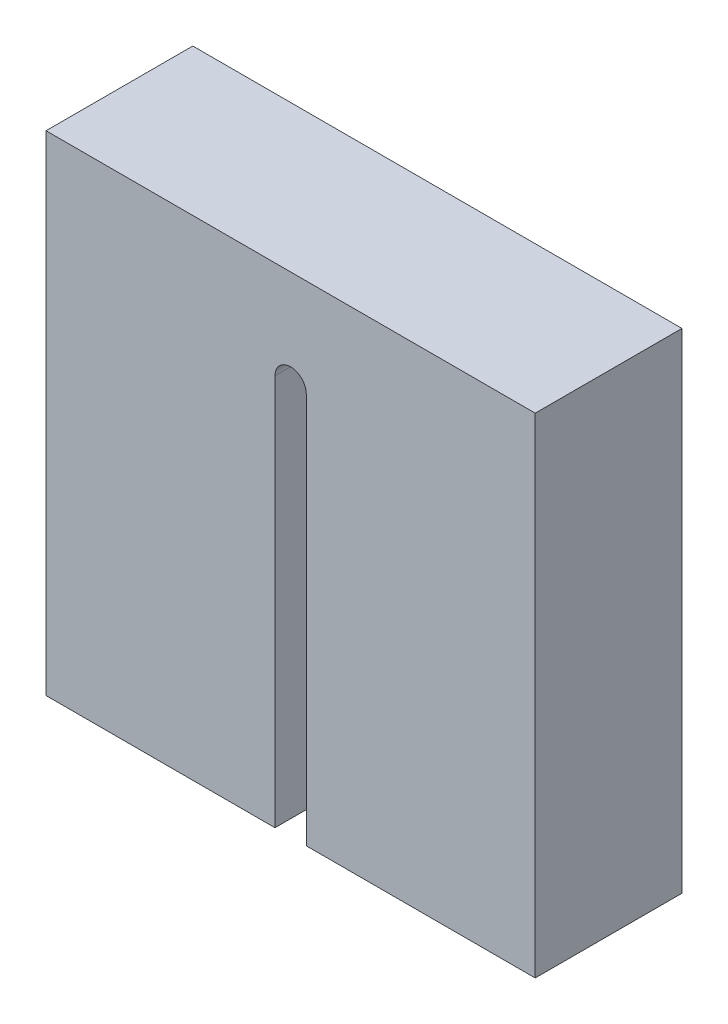
ISO-10303-21;
HEADER;
FILE_DESCRIPTION(('STEP AP214'),'2;1');
FILE_NAME('part.step','',(''),(''),'','','');
FILE_SCHEMA(('AUTOMOTIVE_DESIGN { 1 0 10303 214 1 1 1 1 }'));
ENDSEC;
DATA;
#1=APPLICATION_CONTEXT('core data for automotive mechanical design processes');
#2=APPLICATION_PROTOCOL_DEFINITION('international standard','automotive_design',2000,#1);
#3=PRODUCT_CONTEXT('',#1,'mechanical');
#4=PRODUCT('Part','Part','',(#3));
#5=PRODUCT_RELATED_PRODUCT_CATEGORY('part','',(#4));
#6=PRODUCT_DEFINITION_FORMATION('','',#4);
#7=PRODUCT_DEFINITION_CONTEXT('part definition',#1,'design');
#8=PRODUCT_DEFINITION('design','',#6,#7);
#9=PRODUCT_DEFINITION_SHAPE('','',#8);
#10=(LENGTH_UNIT() NAMED_UNIT(*) SI_UNIT(.MILLI.,.METRE.));
#11=(NAMED_UNIT(*) PLANE_ANGLE_UNIT() SI_UNIT($,.RADIAN.));
#12=(NAMED_UNIT(*) SI_UNIT($,.STERADIAN.) SOLID_ANGLE_UNIT());
#13=UNCERTAINTY_MEASURE_WITH_UNIT(LENGTH_MEASURE(1.E-05),#10,'distance_accuracy_value','');
#14=(GEOMETRIC_REPRESENTATION_CONTEXT(3) GLOBAL_UNCERTAINTY_ASSIGNED_CONTEXT((#13)) GLOBAL_UNIT_ASSIGNED_CONTEXT((#10,
#11,#12)) REPRESENTATION_CONTEXT('',''));
#15=CARTESIAN_POINT('',(0.,0.,0.));
#16=DIRECTION('',(0.,0.,1.));
#17=DIRECTION('',(1.,0.,0.));
#18=AXIS2_PLACEMENT_3D('',#15,#16,#17);
#19=CARTESIAN_POINT('',(0.,0.,15.));
#20=DIRECTION('',(1.,0.,0.));
#21=DIRECTION('',(0.,0.,-1.));
#22=AXIS2_PLACEMENT_3D('',#19,#20,#21);
#23=PLANE('',#22);
#24=DIRECTION('',(0.,-1.,0.));
#25=VECTOR('',#24,1.);
#26=CARTESIAN_POINT('',(0.,0.,0.));
#27=LINE('',#26,#25);
#28=CARTESIAN_POINT('',(0.,50.,0.));
#29=VERTEX_POINT('',#28);
#30=CARTESIAN_POINT('',(0.,0.,0.));
#31=VERTEX_POINT('',#30);
#32=EDGE_CURVE('E94',#29,#31,#27,.T.);
#33=ORIENTED_EDGE('',*,*,#32,.T.);
#34=DIRECTION('',(0.,0.,-1.));
#35=VECTOR('',#34,1.);
#36=CARTESIAN_POINT('',(0.,0.,15.));
#37=LINE('',#36,#35);
#38=CARTESIAN_POINT('',(0.,0.,15.));
#39=VERTEX_POINT('',#38);
#40=EDGE_CURVE('E11',#39,#31,#37,.T.);
#41=ORIENTED_EDGE('',*,*,#40,.F.);
#42=DIRECTION('',(0.,-1.,0.));
#43=VECTOR('',#42,1.);
#44=CARTESIAN_POINT('',(0.,0.,15.));
#45=LINE('',#44,#43);
#46=CARTESIAN_POINT('',(0.,50.,15.));
#47=VERTEX_POINT('',#46);
#48=EDGE_CURVE('E121',#47,#39,#45,.T.);
#49=ORIENTED_EDGE('',*,*,#48,.F.);
#50=DIRECTION('',(0.,0.,-1.));
#51=VECTOR('',#50,1.);
#52=CARTESIAN_POINT('',(0.,50.,15.));
#53=LINE('',#52,#51);
#54=EDGE_CURVE('E107',#47,#29,#53,.T.);
#55=ORIENTED_EDGE('',*,*,#54,.T.);
#56=EDGE_LOOP('',(#33,#41,#49,#55));
#57=FACE_BOUND('',#56,.T.);
#58=ADVANCED_FACE('F26',(#57),#23,.F.);
#59=CARTESIAN_POINT('',(0.,0.,15.));
#60=DIRECTION('',(0.,1.,0.));
#61=DIRECTION('',(0.,0.,1.));
#62=AXIS2_PLACEMENT_3D('',#59,#60,#61);
#63=PLANE('',#62);
#64=DIRECTION('',(1.,0.,0.));
#65=VECTOR('',#64,1.);
#66=CARTESIAN_POINT('',(0.,0.,0.));
#67=LINE('',#66,#65);
#68=CARTESIAN_POINT('',(23.4,0.,0.));
#69=VERTEX_POINT('',#68);
#70=EDGE_CURVE('E90',#31,#69,#67,.T.);
#71=ORIENTED_EDGE('',*,*,#70,.T.);
#72=DIRECTION('',(0.,0.,-1.));
#73=VECTOR('',#72,1.);
#74=CARTESIAN_POINT('',(23.4,0.,15.));
#75=LINE('',#74,#73);
#76=CARTESIAN_POINT('',(23.4,0.,15.));
#77=VERTEX_POINT('',#76);
#78=EDGE_CURVE('E33',#77,#69,#75,.T.);
#79=ORIENTED_EDGE('',*,*,#78,.F.);
#80=DIRECTION('',(1.,0.,0.));
#81=VECTOR('',#80,1.);
#82=CARTESIAN_POINT('',(0.,0.,15.));
#83=LINE('',#82,#81);
#84=EDGE_CURVE('E103',#39,#77,#83,.T.);
#85=ORIENTED_EDGE('',*,*,#84,.F.);
#86=ORIENTED_EDGE('',*,*,#40,.T.);
#87=EDGE_LOOP('',(#71,#79,#85,#86));
#88=FACE_BOUND('',#87,.T.);
#89=ADVANCED_FACE('F102',(#88),#63,.F.);
#90=CARTESIAN_POINT('',(23.4,40.,15.));
#91=DIRECTION('',(-1.,0.,0.));
#92=DIRECTION('',(0.,0.,1.));
#93=AXIS2_PLACEMENT_3D('',#90,#91,#92);
#94=PLANE('',#93);
#95=DIRECTION('',(0.,1.,0.));
#96=VECTOR('',#95,1.);
#97=CARTESIAN_POINT('',(23.4,40.,0.));
#98=LINE('',#97,#96);
#99=CARTESIAN_POINT('',(23.4,40.,0.));
#100=VERTEX_POINT('',#99);
#101=EDGE_CURVE('E96',#69,#100,#98,.T.);
#102=ORIENTED_EDGE('',*,*,#101,.T.);
#103=DIRECTION('',(0.,0.,-1.));
#104=VECTOR('',#103,1.);
#105=CARTESIAN_POINT('',(23.4,40.,15.));
#106=LINE('',#105,#104);
#107=CARTESIAN_POINT('',(23.4,40.,15.));
#108=VERTEX_POINT('',#107);
#109=EDGE_CURVE('E147',#108,#100,#106,.T.);
#110=ORIENTED_EDGE('',*,*,#109,.F.);
#111=DIRECTION('',(0.,1.,0.));
#112=VECTOR('',#111,1.);
#113=CARTESIAN_POINT('',(23.4,40.,15.));
#114=LINE('',#113,#112);
#115=EDGE_CURVE('E124',#77,#108,#114,.T.);
#116=ORIENTED_EDGE('',*,*,#115,.F.);
#117=ORIENTED_EDGE('',*,*,#78,.T.);
#118=EDGE_LOOP('',(#102,#110,#116,#117));
#119=FACE_BOUND('',#118,.T.);
#120=ADVANCED_FACE('F151',(#119),#94,.F.);
#121=CARTESIAN_POINT('',(25.,40.,15.));
#122=DIRECTION('',(0.,0.,-1.));
#123=DIRECTION('',(-1.,0.,0.));
#124=AXIS2_PLACEMENT_3D('',#121,#122,#123);
#125=CYLINDRICAL_SURFACE('',#124,1.60000000000001);
#126=CARTESIAN_POINT('',(25.,40.,0.));
#127=DIRECTION('',(0.,0.,-1.));
#128=DIRECTION('',(-1.,0.,0.));
#129=AXIS2_PLACEMENT_3D('',#126,#127,#128);
#130=CIRCLE('',#129,1.60000000000001);
#131=CARTESIAN_POINT('',(26.6,40.,0.));
#132=VERTEX_POINT('',#131);
#133=EDGE_CURVE('E111',#100,#132,#130,.T.);
#134=ORIENTED_EDGE('',*,*,#133,.T.);
#135=DIRECTION('',(0.,0.,-1.));
#136=VECTOR('',#135,1.);
#137=CARTESIAN_POINT('',(26.6,40.,15.));
#138=LINE('',#137,#136);
#139=CARTESIAN_POINT('',(26.6,40.,15.));
#140=VERTEX_POINT('',#139);
#141=EDGE_CURVE('E144',#140,#132,#138,.T.);
#142=ORIENTED_EDGE('',*,*,#141,.F.);
#143=CARTESIAN_POINT('',(25.,40.,15.));
#144=DIRECTION('',(0.,0.,-1.));
#145=DIRECTION('',(-1.,0.,0.));
#146=AXIS2_PLACEMENT_3D('',#143,#144,#145);
#147=CIRCLE('',#146,1.60000000000001);
#148=EDGE_CURVE('E126',#108,#140,#147,.T.);
#149=ORIENTED_EDGE('',*,*,#148,.F.);
#150=ORIENTED_EDGE('',*,*,#109,.T.);
#151=EDGE_LOOP('',(#134,#142,#149,#150));
#152=FACE_BOUND('',#151,.T.);
#153=ADVANCED_FACE('F159',(#152),#125,.F.);
#154=CARTESIAN_POINT('',(26.6,40.,15.));
#155=DIRECTION('',(1.,0.,0.));
#156=DIRECTION('',(0.,0.,-1.));
#157=AXIS2_PLACEMENT_3D('',#154,#155,#156);
#158=PLANE('',#157);
#159=DIRECTION('',(0.,-1.,0.));
#160=VECTOR('',#159,1.);
#161=CARTESIAN_POINT('',(26.6,40.,0.));
#162=LINE('',#161,#160);
#163=CARTESIAN_POINT('',(26.6,0.,0.));
#164=VERTEX_POINT('',#163);
#165=EDGE_CURVE('E113',#132,#164,#162,.T.);
#166=ORIENTED_EDGE('',*,*,#165,.T.);
#167=DIRECTION('',(0.,0.,-1.));
#168=VECTOR('',#167,1.);
#169=CARTESIAN_POINT('',(26.6,0.,15.));
#170=LINE('',#169,#168);
#171=CARTESIAN_POINT('',(26.6,0.,15.));
#172=VERTEX_POINT('',#171);
#173=EDGE_CURVE('E141',#172,#164,#170,.T.);
#174=ORIENTED_EDGE('',*,*,#173,.F.);
#175=DIRECTION('',(0.,-1.,0.));
#176=VECTOR('',#175,1.);
#177=CARTESIAN_POINT('',(26.6,40.,15.));
#178=LINE('',#177,#176);
#179=EDGE_CURVE('E128',#140,#172,#178,.T.);
#180=ORIENTED_EDGE('',*,*,#179,.F.);
#181=ORIENTED_EDGE('',*,*,#141,.T.);
#182=EDGE_LOOP('',(#166,#174,#180,#181));
#183=FACE_BOUND('',#182,.T.);
#184=ADVANCED_FACE('F162',(#183),#158,.F.);
#185=CARTESIAN_POINT('',(26.6,0.,15.));
#186=DIRECTION('',(0.,1.,0.));
#187=DIRECTION('',(0.,0.,1.));
#188=AXIS2_PLACEMENT_3D('',#185,#186,#187);
#189=PLANE('',#188);
#190=DIRECTION('',(1.,0.,0.));
#191=VECTOR('',#190,1.);
#192=CARTESIAN_POINT('',(26.6,0.,0.));
#193=LINE('',#192,#191);
#194=CARTESIAN_POINT('',(50.,0.,0.));
#195=VERTEX_POINT('',#194);
#196=EDGE_CURVE('E115',#164,#195,#193,.T.);
#197=ORIENTED_EDGE('',*,*,#196,.T.);
#198=DIRECTION('',(0.,0.,-1.));
#199=VECTOR('',#198,1.);
#200=CARTESIAN_POINT('',(50.,0.,15.));
#201=LINE('',#200,#199);
#202=CARTESIAN_POINT('',(50.,0.,15.));
#203=VERTEX_POINT('',#202);
#204=EDGE_CURVE('E138',#203,#195,#201,.T.);
#205=ORIENTED_EDGE('',*,*,#204,.F.);
#206=DIRECTION('',(1.,0.,0.));
#207=VECTOR('',#206,1.);
#208=CARTESIAN_POINT('',(26.6,0.,15.));
#209=LINE('',#208,#207);
#210=EDGE_CURVE('E130',#172,#203,#209,.T.);
#211=ORIENTED_EDGE('',*,*,#210,.F.);
#212=ORIENTED_EDGE('',*,*,#173,.T.);
#213=EDGE_LOOP('',(#197,#205,#211,#212));
#214=FACE_BOUND('',#213,.T.);
#215=ADVANCED_FACE('F167',(#214),#189,.F.);
#216=CARTESIAN_POINT('',(50.,0.,15.));
#217=DIRECTION('',(-1.,0.,0.));
#218=DIRECTION('',(0.,0.,1.));
#219=AXIS2_PLACEMENT_3D('',#216,#217,#218);
#220=PLANE('',#219);
#221=DIRECTION('',(0.,1.,0.));
#222=VECTOR('',#221,1.);
#223=CARTESIAN_POINT('',(50.,0.,0.));
#224=LINE('',#223,#222);
#225=CARTESIAN_POINT('',(50.,50.,0.));
#226=VERTEX_POINT('',#225);
#227=EDGE_CURVE('E117',#195,#226,#224,.T.);
#228=ORIENTED_EDGE('',*,*,#227,.T.);
#229=DIRECTION('',(0.,0.,-1.));
#230=VECTOR('',#229,1.);
#231=CARTESIAN_POINT('',(50.,50.,15.));
#232=LINE('',#231,#230);
#233=CARTESIAN_POINT('',(50.,50.,15.));
#234=VERTEX_POINT('',#233);
#235=EDGE_CURVE('E135',#234,#226,#232,.T.);
#236=ORIENTED_EDGE('',*,*,#235,.F.);
#237=DIRECTION('',(0.,1.,0.));
#238=VECTOR('',#237,1.);
#239=CARTESIAN_POINT('',(50.,0.,15.));
#240=LINE('',#239,#238);
#241=EDGE_CURVE('E45',#203,#234,#240,.T.);
#242=ORIENTED_EDGE('',*,*,#241,.F.);
#243=ORIENTED_EDGE('',*,*,#204,.T.);
#244=EDGE_LOOP('',(#228,#236,#242,#243));
#245=FACE_BOUND('',#244,.T.);
#246=ADVANCED_FACE('F170',(#245),#220,.F.);
#247=CARTESIAN_POINT('',(0.,50.,15.));
#248=DIRECTION('',(0.,-1.,0.));
#249=DIRECTION('',(0.,0.,-1.));
#250=AXIS2_PLACEMENT_3D('',#247,#248,#249);
#251=PLANE('',#250);
#252=DIRECTION('',(-1.,0.,0.));
#253=VECTOR('',#252,1.);
#254=CARTESIAN_POINT('',(0.,50.,0.));
#255=LINE('',#254,#253);
#256=EDGE_CURVE('E119',#226,#29,#255,.T.);
#257=ORIENTED_EDGE('',*,*,#256,.T.);
#258=ORIENTED_EDGE('',*,*,#54,.F.);
#259=DIRECTION('',(-1.,0.,0.));
#260=VECTOR('',#259,1.);
#261=CARTESIAN_POINT('',(0.,50.,15.));
#262=LINE('',#261,#260);
#263=EDGE_CURVE('E40',#234,#47,#262,.T.);
#264=ORIENTED_EDGE('',*,*,#263,.F.);
#265=ORIENTED_EDGE('',*,*,#235,.T.);
#266=EDGE_LOOP('',(#257,#258,#264,#265));
#267=FACE_BOUND('',#266,.T.);
#268=ADVANCED_FACE('F172',(#267),#251,.F.);
#269=CARTESIAN_POINT('',(25.,40.,15.));
#270=DIRECTION('',(0.,0.,-1.));
#271=DIRECTION('',(-1.,0.,0.));
#272=AXIS2_PLACEMENT_3D('',#269,#270,#271);
#273=PLANE('',#272);
#274=ORIENTED_EDGE('',*,*,#48,.T.);
#275=ORIENTED_EDGE('',*,*,#84,.T.);
#276=ORIENTED_EDGE('',*,*,#115,.T.);
#277=ORIENTED_EDGE('',*,*,#148,.T.);
#278=ORIENTED_EDGE('',*,*,#179,.T.);
#279=ORIENTED_EDGE('',*,*,#210,.T.);
#280=ORIENTED_EDGE('',*,*,#241,.T.);
#281=ORIENTED_EDGE('',*,*,#263,.T.);
#282=EDGE_LOOP('',(#274,#275,#276,#277,#278,#279,#280,#281));
#283=FACE_BOUND('',#282,.T.);
#284=ADVANCED_FACE('F154',(#283),#273,.F.);
#285=CARTESIAN_POINT('',(25.,40.,0.));
#286=DIRECTION('',(0.,0.,-1.));
#287=DIRECTION('',(-1.,0.,0.));
#288=AXIS2_PLACEMENT_3D('',#285,#286,#287);
#289=PLANE('',#288);
#290=ORIENTED_EDGE('',*,*,#32,.F.);
#291=ORIENTED_EDGE('',*,*,#256,.F.);
#292=ORIENTED_EDGE('',*,*,#227,.F.);
#293=ORIENTED_EDGE('',*,*,#196,.F.);
#294=ORIENTED_EDGE('',*,*,#165,.F.);
#295=ORIENTED_EDGE('',*,*,#133,.F.);
#296=ORIENTED_EDGE('',*,*,#101,.F.);
#297=ORIENTED_EDGE('',*,*,#70,.F.);
#298=EDGE_LOOP('',(#290,#291,#292,#293,#294,#295,#296,#297));
#299=FACE_BOUND('',#298,.T.);
#300=ADVANCED_FACE('F91',(#299),#289,.T.);
#301=CLOSED_SHELL('',(#58,#89,#120,#153,#184,#215,#246,#268,#284,#300));
#302=MANIFOLD_SOLID_BREP('B2',#301);
#303=ADVANCED_BREP_SHAPE_REPRESENTATION('',(#18,#302),#14);
#304=SHAPE_DEFINITION_REPRESENTATION(#9,#303);
ENDSEC;
END-ISO-10303-21;
